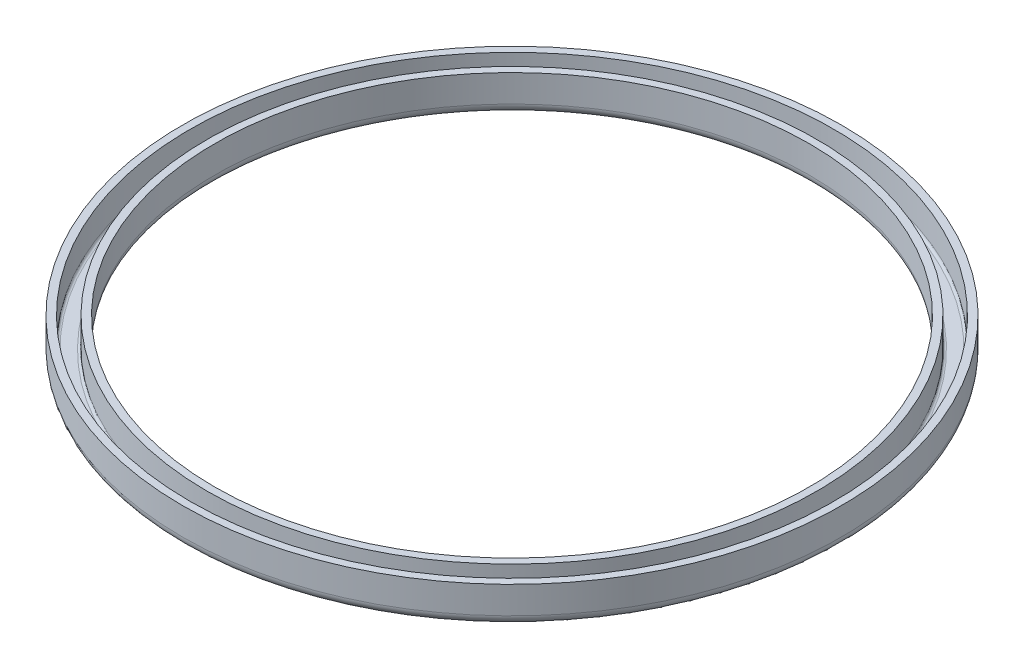
ISO-10303-21;
HEADER;
FILE_DESCRIPTION(('STEP AP214'),'2;1');
FILE_NAME('part.step','',(''),(''),'','','');
FILE_SCHEMA(('AUTOMOTIVE_DESIGN { 1 0 10303 214 1 1 1 1 }'));
ENDSEC;
DATA;
#1=APPLICATION_CONTEXT('core data for automotive mechanical design processes');
#2=APPLICATION_PROTOCOL_DEFINITION('international standard','automotive_design',2000,#1);
#3=PRODUCT_CONTEXT('',#1,'mechanical');
#4=PRODUCT('Part','Part','',(#3));
#5=PRODUCT_RELATED_PRODUCT_CATEGORY('part','',(#4));
#6=PRODUCT_DEFINITION_FORMATION('','',#4);
#7=PRODUCT_DEFINITION_CONTEXT('part definition',#1,'design');
#8=PRODUCT_DEFINITION('design','',#6,#7);
#9=PRODUCT_DEFINITION_SHAPE('','',#8);
#10=(LENGTH_UNIT() NAMED_UNIT(*) SI_UNIT(.MILLI.,.METRE.));
#11=(NAMED_UNIT(*) PLANE_ANGLE_UNIT() SI_UNIT($,.RADIAN.));
#12=(NAMED_UNIT(*) SI_UNIT($,.STERADIAN.) SOLID_ANGLE_UNIT());
#13=UNCERTAINTY_MEASURE_WITH_UNIT(LENGTH_MEASURE(1.E-05),#10,'distance_accuracy_value','');
#14=(GEOMETRIC_REPRESENTATION_CONTEXT(3) GLOBAL_UNCERTAINTY_ASSIGNED_CONTEXT((#13)) GLOBAL_UNIT_ASSIGNED_CONTEXT((#10,
#11,#12)) REPRESENTATION_CONTEXT('',''));
#15=CARTESIAN_POINT('',(0.,0.,0.));
#16=DIRECTION('',(0.,0.,1.));
#17=DIRECTION('',(1.,0.,0.));
#18=AXIS2_PLACEMENT_3D('',#15,#16,#17);
#19=CARTESIAN_POINT('',(0.,25.194951605278,0.));
#20=DIRECTION('',(0.,1.,0.));
#21=DIRECTION('',(0.,0.,1.));
#22=AXIS2_PLACEMENT_3D('',#19,#20,#21);
#23=CYLINDRICAL_SURFACE('',#22,6.);
#24=CARTESIAN_POINT('',(0.,0.750000000000001,0.));
#25=DIRECTION('',(0.,1.,0.));
#26=DIRECTION('',(0.,0.,1.));
#27=AXIS2_PLACEMENT_3D('',#24,#25,#26);
#28=CIRCLE('',#27,6.);
#29=CARTESIAN_POINT('',(0.,0.750000000000001,6.));
#30=VERTEX_POINT('',#29);
#31=EDGE_CURVE('E10',#30,#30,#28,.T.);
#32=ORIENTED_EDGE('',*,*,#31,.T.);
#33=EDGE_LOOP('',(#32));
#34=FACE_BOUND('',#33,.T.);
#35=CARTESIAN_POINT('',(0.,0.199999999999999,0.));
#36=DIRECTION('',(0.,1.,0.));
#37=DIRECTION('',(0.,0.,1.));
#38=AXIS2_PLACEMENT_3D('',#35,#36,#37);
#39=CIRCLE('',#38,6.);
#40=CARTESIAN_POINT('',(0.,0.199999999999999,6.));
#41=VERTEX_POINT('',#40);
#42=EDGE_CURVE('E70',#41,#41,#39,.T.);
#43=ORIENTED_EDGE('',*,*,#42,.F.);
#44=EDGE_LOOP('',(#43));
#45=FACE_BOUND('',#44,.T.);
#46=ADVANCED_FACE('F30',(#34,#45),#23,.F.);
#47=CARTESIAN_POINT('',(-6.15,0.75,0.));
#48=DIRECTION('',(0.,-1.,0.));
#49=DIRECTION('',(0.,0.,-1.));
#50=AXIS2_PLACEMENT_3D('',#47,#48,#49);
#51=PLANE('',#50);
#52=ORIENTED_EDGE('',*,*,#31,.F.);
#53=EDGE_LOOP('',(#52));
#54=FACE_BOUND('',#53,.T.);
#55=CARTESIAN_POINT('',(0.,0.750000000000001,0.));
#56=DIRECTION('',(0.,1.,0.));
#57=DIRECTION('',(0.,0.,1.));
#58=AXIS2_PLACEMENT_3D('',#55,#56,#57);
#59=CIRCLE('',#58,6.15);
#60=CARTESIAN_POINT('',(0.,0.750000000000001,6.15));
#61=VERTEX_POINT('',#60);
#62=EDGE_CURVE('E36',#61,#61,#59,.T.);
#63=ORIENTED_EDGE('',*,*,#62,.T.);
#64=EDGE_LOOP('',(#63));
#65=FACE_BOUND('',#64,.T.);
#66=ADVANCED_FACE('F78',(#54,#65),#51,.F.);
#67=CARTESIAN_POINT('',(0.,25.194951605278,0.));
#68=DIRECTION('',(0.,1.,0.));
#69=DIRECTION('',(0.,0.,1.));
#70=AXIS2_PLACEMENT_3D('',#67,#68,#69);
#71=CYLINDRICAL_SURFACE('',#70,6.15);
#72=ORIENTED_EDGE('',*,*,#62,.F.);
#73=EDGE_LOOP('',(#72));
#74=FACE_BOUND('',#73,.T.);
#75=CARTESIAN_POINT('',(0.,0.199999999999999,0.));
#76=DIRECTION('',(0.,1.,0.));
#77=DIRECTION('',(0.,0.,1.));
#78=AXIS2_PLACEMENT_3D('',#75,#76,#77);
#79=CIRCLE('',#78,6.15);
#80=CARTESIAN_POINT('',(0.,0.199999999999999,6.15));
#81=VERTEX_POINT('',#80);
#82=EDGE_CURVE('E40',#81,#81,#79,.T.);
#83=ORIENTED_EDGE('',*,*,#82,.T.);
#84=EDGE_LOOP('',(#83));
#85=FACE_BOUND('',#84,.T.);
#86=ADVANCED_FACE('F82',(#74,#85),#71,.T.);
#87=CARTESIAN_POINT('',(0.,0.2,0.));
#88=DIRECTION('',(0.,1.,0.));
#89=DIRECTION('',(0.,0.,1.));
#90=AXIS2_PLACEMENT_3D('',#87,#88,#89);
#91=TOROIDAL_SURFACE('',#90,6.2,0.0499999999999994);
#92=ORIENTED_EDGE('',*,*,#82,.F.);
#93=EDGE_LOOP('',(#92));
#94=FACE_BOUND('',#93,.T.);
#95=CARTESIAN_POINT('',(0.,0.150000000000001,0.));
#96=DIRECTION('',(0.,1.,0.));
#97=DIRECTION('',(0.,0.,1.));
#98=AXIS2_PLACEMENT_3D('',#95,#96,#97);
#99=CIRCLE('',#98,6.2);
#100=CARTESIAN_POINT('',(0.,0.150000000000001,6.2));
#101=VERTEX_POINT('',#100);
#102=EDGE_CURVE('E44',#101,#101,#99,.T.);
#103=ORIENTED_EDGE('',*,*,#102,.T.);
#104=EDGE_LOOP('',(#103));
#105=FACE_BOUND('',#104,.T.);
#106=ADVANCED_FACE('F87',(#94,#105),#91,.F.);
#107=CARTESIAN_POINT('',(-6.45,0.15,0.));
#108=DIRECTION('',(0.,-1.,0.));
#109=DIRECTION('',(0.,0.,-1.));
#110=AXIS2_PLACEMENT_3D('',#107,#108,#109);
#111=PLANE('',#110);
#112=ORIENTED_EDGE('',*,*,#102,.F.);
#113=EDGE_LOOP('',(#112));
#114=FACE_BOUND('',#113,.T.);
#115=CARTESIAN_POINT('',(0.,0.150000000000001,0.));
#116=DIRECTION('',(0.,1.,0.));
#117=DIRECTION('',(0.,0.,1.));
#118=AXIS2_PLACEMENT_3D('',#115,#116,#117);
#119=CIRCLE('',#118,6.45);
#120=CARTESIAN_POINT('',(0.,0.150000000000001,6.45));
#121=VERTEX_POINT('',#120);
#122=EDGE_CURVE('E49',#121,#121,#119,.T.);
#123=ORIENTED_EDGE('',*,*,#122,.T.);
#124=EDGE_LOOP('',(#123));
#125=FACE_BOUND('',#124,.T.);
#126=ADVANCED_FACE('F93',(#114,#125),#111,.F.);
#127=CARTESIAN_POINT('',(0.,0.2,0.));
#128=DIRECTION('',(0.,1.,0.));
#129=DIRECTION('',(0.,0.,1.));
#130=AXIS2_PLACEMENT_3D('',#127,#128,#129);
#131=TOROIDAL_SURFACE('',#130,6.45,0.0499999999999994);
#132=ORIENTED_EDGE('',*,*,#122,.F.);
#133=EDGE_LOOP('',(#132));
#134=FACE_BOUND('',#133,.T.);
#135=CARTESIAN_POINT('',(0.,0.199999999999999,0.));
#136=DIRECTION('',(0.,1.,0.));
#137=DIRECTION('',(0.,0.,1.));
#138=AXIS2_PLACEMENT_3D('',#135,#136,#137);
#139=CIRCLE('',#138,6.5);
#140=CARTESIAN_POINT('',(0.,0.199999999999999,6.5));
#141=VERTEX_POINT('',#140);
#142=EDGE_CURVE('E52',#141,#141,#139,.T.);
#143=ORIENTED_EDGE('',*,*,#142,.T.);
#144=EDGE_LOOP('',(#143));
#145=FACE_BOUND('',#144,.T.);
#146=ADVANCED_FACE('F97',(#134,#145),#131,.F.);
#147=CARTESIAN_POINT('',(0.,25.194951605278,0.));
#148=DIRECTION('',(0.,1.,0.));
#149=DIRECTION('',(0.,0.,1.));
#150=AXIS2_PLACEMENT_3D('',#147,#148,#149);
#151=CYLINDRICAL_SURFACE('',#150,6.5);
#152=ORIENTED_EDGE('',*,*,#142,.F.);
#153=EDGE_LOOP('',(#152));
#154=FACE_BOUND('',#153,.T.);
#155=CARTESIAN_POINT('',(0.,0.750000000000001,0.));
#156=DIRECTION('',(0.,1.,0.));
#157=DIRECTION('',(0.,0.,1.));
#158=AXIS2_PLACEMENT_3D('',#155,#156,#157);
#159=CIRCLE('',#158,6.5);
#160=CARTESIAN_POINT('',(0.,0.750000000000001,6.5));
#161=VERTEX_POINT('',#160);
#162=EDGE_CURVE('E55',#161,#161,#159,.T.);
#163=ORIENTED_EDGE('',*,*,#162,.T.);
#164=EDGE_LOOP('',(#163));
#165=FACE_BOUND('',#164,.T.);
#166=ADVANCED_FACE('F101',(#154,#165),#151,.F.);
#167=CARTESIAN_POINT('',(-6.65,0.75,0.));
#168=DIRECTION('',(0.,-1.,0.));
#169=DIRECTION('',(0.,0.,-1.));
#170=AXIS2_PLACEMENT_3D('',#167,#168,#169);
#171=PLANE('',#170);
#172=ORIENTED_EDGE('',*,*,#162,.F.);
#173=EDGE_LOOP('',(#172));
#174=FACE_BOUND('',#173,.T.);
#175=CARTESIAN_POINT('',(0.,0.750000000000001,0.));
#176=DIRECTION('',(0.,1.,0.));
#177=DIRECTION('',(0.,0.,1.));
#178=AXIS2_PLACEMENT_3D('',#175,#176,#177);
#179=CIRCLE('',#178,6.65);
#180=CARTESIAN_POINT('',(0.,0.750000000000001,6.65));
#181=VERTEX_POINT('',#180);
#182=EDGE_CURVE('E58',#181,#181,#179,.T.);
#183=ORIENTED_EDGE('',*,*,#182,.T.);
#184=EDGE_LOOP('',(#183));
#185=FACE_BOUND('',#184,.T.);
#186=ADVANCED_FACE('F105',(#174,#185),#171,.F.);
#187=CARTESIAN_POINT('',(0.,25.194951605278,0.));
#188=DIRECTION('',(0.,1.,0.));
#189=DIRECTION('',(0.,0.,1.));
#190=AXIS2_PLACEMENT_3D('',#187,#188,#189);
#191=CYLINDRICAL_SURFACE('',#190,6.65);
#192=CARTESIAN_POINT('',(0.,0.199999999999999,0.));
#193=DIRECTION('',(0.,1.,0.));
#194=DIRECTION('',(0.,0.,1.));
#195=AXIS2_PLACEMENT_3D('',#192,#193,#194);
#196=CIRCLE('',#195,6.65);
#197=CARTESIAN_POINT('',(0.,0.199999999999999,6.65));
#198=VERTEX_POINT('',#197);
#199=EDGE_CURVE('E61',#198,#198,#196,.T.);
#200=ORIENTED_EDGE('',*,*,#199,.T.);
#201=EDGE_LOOP('',(#200));
#202=FACE_BOUND('',#201,.T.);
#203=ORIENTED_EDGE('',*,*,#182,.F.);
#204=EDGE_LOOP('',(#203));
#205=FACE_BOUND('',#204,.T.);
#206=ADVANCED_FACE('F109',(#202,#205),#191,.T.);
#207=CARTESIAN_POINT('',(0.,0.2,0.));
#208=DIRECTION('',(0.,1.,0.));
#209=DIRECTION('',(0.,0.,1.));
#210=AXIS2_PLACEMENT_3D('',#207,#208,#209);
#211=TOROIDAL_SURFACE('',#210,6.45,0.199999999999999);
#212=CARTESIAN_POINT('',(0.,0.,0.));
#213=DIRECTION('',(0.,1.,0.));
#214=DIRECTION('',(0.,0.,1.));
#215=AXIS2_PLACEMENT_3D('',#212,#213,#214);
#216=CIRCLE('',#215,6.45);
#217=CARTESIAN_POINT('',(0.,0.,6.45));
#218=VERTEX_POINT('',#217);
#219=EDGE_CURVE('E64',#218,#218,#216,.T.);
#220=ORIENTED_EDGE('',*,*,#219,.T.);
#221=EDGE_LOOP('',(#220));
#222=FACE_BOUND('',#221,.T.);
#223=ORIENTED_EDGE('',*,*,#199,.F.);
#224=EDGE_LOOP('',(#223));
#225=FACE_BOUND('',#224,.T.);
#226=ADVANCED_FACE('F113',(#222,#225),#211,.T.);
#227=CARTESIAN_POINT('',(-6.45,0.,0.));
#228=DIRECTION('',(0.,-1.,0.));
#229=DIRECTION('',(0.,0.,-1.));
#230=AXIS2_PLACEMENT_3D('',#227,#228,#229);
#231=PLANE('',#230);
#232=CARTESIAN_POINT('',(0.,0.,0.));
#233=DIRECTION('',(0.,1.,0.));
#234=DIRECTION('',(0.,0.,1.));
#235=AXIS2_PLACEMENT_3D('',#232,#233,#234);
#236=CIRCLE('',#235,6.2);
#237=CARTESIAN_POINT('',(0.,0.,6.2));
#238=VERTEX_POINT('',#237);
#239=EDGE_CURVE('E67',#238,#238,#236,.T.);
#240=ORIENTED_EDGE('',*,*,#239,.T.);
#241=EDGE_LOOP('',(#240));
#242=FACE_BOUND('',#241,.T.);
#243=ORIENTED_EDGE('',*,*,#219,.F.);
#244=EDGE_LOOP('',(#243));
#245=FACE_BOUND('',#244,.T.);
#246=ADVANCED_FACE('F117',(#242,#245),#231,.T.);
#247=CARTESIAN_POINT('',(0.,0.2,0.));
#248=DIRECTION('',(0.,1.,0.));
#249=DIRECTION('',(0.,0.,1.));
#250=AXIS2_PLACEMENT_3D('',#247,#248,#249);
#251=TOROIDAL_SURFACE('',#250,6.2,0.199999999999999);
#252=ORIENTED_EDGE('',*,*,#42,.T.);
#253=EDGE_LOOP('',(#252));
#254=FACE_BOUND('',#253,.T.);
#255=ORIENTED_EDGE('',*,*,#239,.F.);
#256=EDGE_LOOP('',(#255));
#257=FACE_BOUND('',#256,.T.);
#258=ADVANCED_FACE('F74',(#254,#257),#251,.T.);
#259=CLOSED_SHELL('',(#46,#66,#86,#106,#126,#146,#166,#186,#206,#226,#246,#258));
#260=MANIFOLD_SOLID_BREP('B2',#259);
#261=ADVANCED_BREP_SHAPE_REPRESENTATION('',(#18,#260),#14);
#262=SHAPE_DEFINITION_REPRESENTATION(#9,#261);
ENDSEC;
END-ISO-10303-21;
